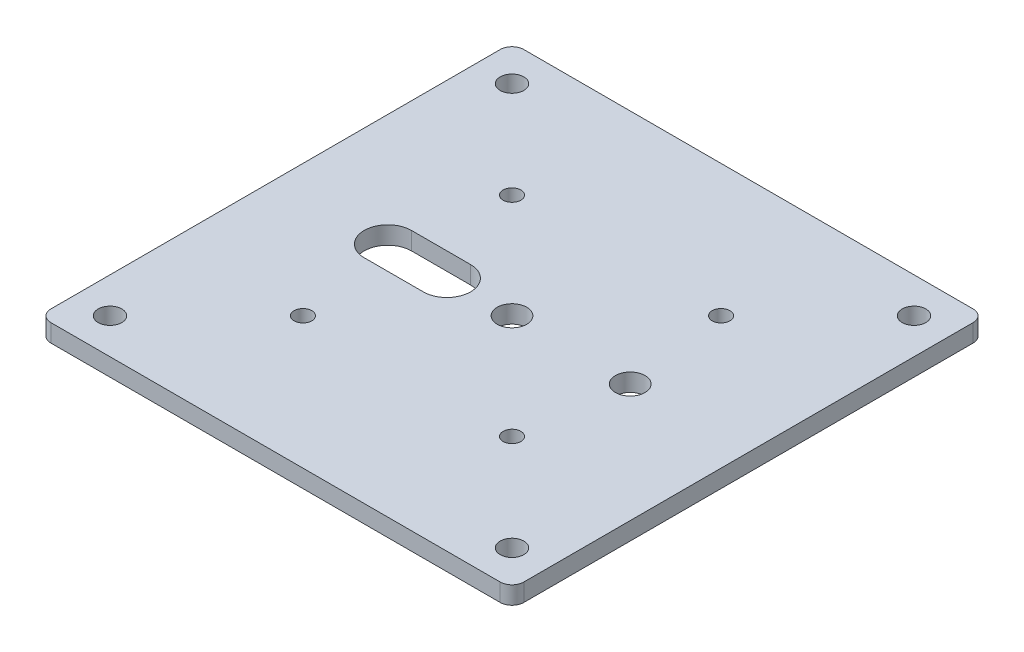
ISO-10303-21;
HEADER;
FILE_DESCRIPTION(('STEP AP214'),'2;1');
FILE_NAME('part.step','',(''),(''),'','','');
FILE_SCHEMA(('AUTOMOTIVE_DESIGN { 1 0 10303 214 1 1 1 1 }'));
ENDSEC;
DATA;
#1=APPLICATION_CONTEXT('core data for automotive mechanical design processes');
#2=APPLICATION_PROTOCOL_DEFINITION('international standard','automotive_design',2000,#1);
#3=PRODUCT_CONTEXT('',#1,'mechanical');
#4=PRODUCT('Part','Part','',(#3));
#5=PRODUCT_RELATED_PRODUCT_CATEGORY('part','',(#4));
#6=PRODUCT_DEFINITION_FORMATION('','',#4);
#7=PRODUCT_DEFINITION_CONTEXT('part definition',#1,'design');
#8=PRODUCT_DEFINITION('design','',#6,#7);
#9=PRODUCT_DEFINITION_SHAPE('','',#8);
#10=(LENGTH_UNIT() NAMED_UNIT(*) SI_UNIT(.MILLI.,.METRE.));
#11=(NAMED_UNIT(*) PLANE_ANGLE_UNIT() SI_UNIT($,.RADIAN.));
#12=(NAMED_UNIT(*) SI_UNIT($,.STERADIAN.) SOLID_ANGLE_UNIT());
#13=UNCERTAINTY_MEASURE_WITH_UNIT(LENGTH_MEASURE(1.E-05),#10,'distance_accuracy_value','');
#14=(GEOMETRIC_REPRESENTATION_CONTEXT(3) GLOBAL_UNCERTAINTY_ASSIGNED_CONTEXT((#13)) GLOBAL_UNIT_ASSIGNED_CONTEXT((#10,
#11,#12)) REPRESENTATION_CONTEXT('',''));
#15=CARTESIAN_POINT('',(0.,0.,0.));
#16=DIRECTION('',(0.,0.,1.));
#17=DIRECTION('',(1.,0.,0.));
#18=AXIS2_PLACEMENT_3D('',#15,#16,#17);
#19=CARTESIAN_POINT('',(0.,3.,-80.));
#20=DIRECTION('',(0.,-1.,0.));
#21=DIRECTION('',(0.,0.,-1.));
#22=AXIS2_PLACEMENT_3D('',#19,#20,#21);
#23=PLANE('',#22);
#24=CARTESIAN_POINT('',(74.,3.,-6.00000000000001));
#25=DIRECTION('',(0.,1.,0.));
#26=DIRECTION('',(0.,0.,1.));
#27=AXIS2_PLACEMENT_3D('',#24,#25,#26);
#28=CIRCLE('',#27,2.00000000000001);
#29=CARTESIAN_POINT('',(74.,3.,-3.99999999999999));
#30=VERTEX_POINT('',#29);
#31=EDGE_CURVE('E401',#30,#30,#28,.T.);
#32=ORIENTED_EDGE('',*,*,#31,.F.);
#33=EDGE_LOOP('',(#32));
#34=FACE_BOUND('',#33,.T.);
#35=CARTESIAN_POINT('',(6.00000000000001,3.,-74.));
#36=DIRECTION('',(0.,1.,0.));
#37=DIRECTION('',(0.,0.,1.));
#38=AXIS2_PLACEMENT_3D('',#35,#36,#37);
#39=CIRCLE('',#38,2.);
#40=CARTESIAN_POINT('',(6.00000000000001,3.,-72.));
#41=VERTEX_POINT('',#40);
#42=EDGE_CURVE('E156',#41,#41,#39,.T.);
#43=ORIENTED_EDGE('',*,*,#42,.F.);
#44=EDGE_LOOP('',(#43));
#45=FACE_BOUND('',#44,.T.);
#46=CARTESIAN_POINT('',(57.6776695296637,3.,-22.3223304703363));
#47=DIRECTION('',(0.,1.,0.));
#48=DIRECTION('',(0.,0.,-1.));
#49=AXIS2_PLACEMENT_3D('',#46,#47,#48);
#50=CIRCLE('',#49,1.5);
#51=CARTESIAN_POINT('',(57.6776695296637,3.,-23.8223304703363));
#52=VERTEX_POINT('',#51);
#53=EDGE_CURVE('E167',#52,#52,#50,.T.);
#54=ORIENTED_EDGE('',*,*,#53,.F.);
#55=EDGE_LOOP('',(#54));
#56=FACE_BOUND('',#55,.T.);
#57=CARTESIAN_POINT('',(22.3223304703363,3.,-22.3223304703363));
#58=DIRECTION('',(0.,1.,0.));
#59=DIRECTION('',(0.,0.,-1.));
#60=AXIS2_PLACEMENT_3D('',#57,#58,#59);
#61=CIRCLE('',#60,1.5);
#62=CARTESIAN_POINT('',(22.3223304703363,3.,-23.8223304703363));
#63=VERTEX_POINT('',#62);
#64=EDGE_CURVE('E179',#63,#63,#61,.T.);
#65=ORIENTED_EDGE('',*,*,#64,.F.);
#66=EDGE_LOOP('',(#65));
#67=FACE_BOUND('',#66,.T.);
#68=CARTESIAN_POINT('',(60.,3.,-40.));
#69=DIRECTION('',(0.,1.,0.));
#70=DIRECTION('',(0.,0.,1.));
#71=AXIS2_PLACEMENT_3D('',#68,#69,#70);
#72=CIRCLE('',#71,2.5);
#73=CARTESIAN_POINT('',(60.,3.,-37.5));
#74=VERTEX_POINT('',#73);
#75=EDGE_CURVE('E191',#74,#74,#72,.T.);
#76=ORIENTED_EDGE('',*,*,#75,.F.);
#77=EDGE_LOOP('',(#76));
#78=FACE_BOUND('',#77,.T.);
#79=DIRECTION('',(0.,0.,-1.));
#80=VECTOR('',#79,1.);
#81=CARTESIAN_POINT('',(80.,3.,0.));
#82=LINE('',#81,#80);
#83=CARTESIAN_POINT('',(80.,3.,-2.));
#84=VERTEX_POINT('',#83);
#85=CARTESIAN_POINT('',(80.,3.,-78.));
#86=VERTEX_POINT('',#85);
#87=EDGE_CURVE('E208',#84,#86,#82,.T.);
#88=ORIENTED_EDGE('',*,*,#87,.T.);
#89=CARTESIAN_POINT('',(78.,3.,-78.));
#90=DIRECTION('',(0.,-1.,0.));
#91=DIRECTION('',(0.,0.,-1.));
#92=AXIS2_PLACEMENT_3D('',#89,#90,#91);
#93=CIRCLE('',#92,2.);
#94=CARTESIAN_POINT('',(78.,3.,-80.));
#95=VERTEX_POINT('',#94);
#96=EDGE_CURVE('E246',#86,#95,#93,.F.);
#97=ORIENTED_EDGE('',*,*,#96,.T.);
#98=DIRECTION('',(-1.,0.,0.));
#99=VECTOR('',#98,1.);
#100=CARTESIAN_POINT('',(0.,3.,-80.));
#101=LINE('',#100,#99);
#102=CARTESIAN_POINT('',(2.,3.,-80.));
#103=VERTEX_POINT('',#102);
#104=EDGE_CURVE('E211',#95,#103,#101,.T.);
#105=ORIENTED_EDGE('',*,*,#104,.T.);
#106=CARTESIAN_POINT('',(2.,3.,-78.));
#107=DIRECTION('',(0.,-1.,0.));
#108=DIRECTION('',(0.,0.,-1.));
#109=AXIS2_PLACEMENT_3D('',#106,#107,#108);
#110=CIRCLE('',#109,2.);
#111=CARTESIAN_POINT('',(0.,3.,-78.));
#112=VERTEX_POINT('',#111);
#113=EDGE_CURVE('E242',#103,#112,#110,.F.);
#114=ORIENTED_EDGE('',*,*,#113,.T.);
#115=DIRECTION('',(0.,0.,1.));
#116=VECTOR('',#115,1.);
#117=CARTESIAN_POINT('',(0.,3.,0.));
#118=LINE('',#117,#116);
#119=CARTESIAN_POINT('',(0.,3.,-2.));
#120=VERTEX_POINT('',#119);
#121=EDGE_CURVE('E203',#112,#120,#118,.T.);
#122=ORIENTED_EDGE('',*,*,#121,.T.);
#123=CARTESIAN_POINT('',(2.,3.,-2.));
#124=DIRECTION('',(0.,-1.,0.));
#125=DIRECTION('',(0.,0.,-1.));
#126=AXIS2_PLACEMENT_3D('',#123,#124,#125);
#127=CIRCLE('',#126,2.);
#128=CARTESIAN_POINT('',(2.,3.,0.));
#129=VERTEX_POINT('',#128);
#130=EDGE_CURVE('E52',#120,#129,#127,.F.);
#131=ORIENTED_EDGE('',*,*,#130,.T.);
#132=DIRECTION('',(1.,0.,0.));
#133=VECTOR('',#132,1.);
#134=CARTESIAN_POINT('',(0.,3.,0.));
#135=LINE('',#134,#133);
#136=CARTESIAN_POINT('',(78.,3.,0.));
#137=VERTEX_POINT('',#136);
#138=EDGE_CURVE('E205',#129,#137,#135,.T.);
#139=ORIENTED_EDGE('',*,*,#138,.T.);
#140=CARTESIAN_POINT('',(78.,3.,-2.));
#141=DIRECTION('',(0.,-1.,0.));
#142=DIRECTION('',(0.,0.,-1.));
#143=AXIS2_PLACEMENT_3D('',#140,#141,#142);
#144=CIRCLE('',#143,2.);
#145=EDGE_CURVE('E244',#137,#84,#144,.F.);
#146=ORIENTED_EDGE('',*,*,#145,.T.);
#147=EDGE_LOOP('',(#88,#97,#105,#114,#122,#131,#139,#146));
#148=FACE_BOUND('',#147,.T.);
#149=CARTESIAN_POINT('',(40.,3.,-40.));
#150=DIRECTION('',(0.,1.,0.));
#151=DIRECTION('',(0.,0.,1.));
#152=AXIS2_PLACEMENT_3D('',#149,#150,#151);
#153=CIRCLE('',#152,2.5);
#154=CARTESIAN_POINT('',(40.,3.,-37.5));
#155=VERTEX_POINT('',#154);
#156=EDGE_CURVE('E197',#155,#155,#153,.T.);
#157=ORIENTED_EDGE('',*,*,#156,.F.);
#158=EDGE_LOOP('',(#157));
#159=FACE_BOUND('',#158,.T.);
#160=CARTESIAN_POINT('',(57.6776695296637,3.,-57.6776695296637));
#161=DIRECTION('',(0.,1.,0.));
#162=DIRECTION('',(0.,0.,1.));
#163=AXIS2_PLACEMENT_3D('',#160,#161,#162);
#164=CIRCLE('',#163,1.5);
#165=CARTESIAN_POINT('',(57.6776695296637,3.,-56.1776695296637));
#166=VERTEX_POINT('',#165);
#167=EDGE_CURVE('E185',#166,#166,#164,.T.);
#168=ORIENTED_EDGE('',*,*,#167,.F.);
#169=EDGE_LOOP('',(#168));
#170=FACE_BOUND('',#169,.T.);
#171=CARTESIAN_POINT('',(22.3223304703363,3.,-57.6776695296637));
#172=DIRECTION('',(0.,1.,0.));
#173=DIRECTION('',(0.,0.,1.));
#174=AXIS2_PLACEMENT_3D('',#171,#172,#173);
#175=CIRCLE('',#174,1.5);
#176=CARTESIAN_POINT('',(22.3223304703363,3.,-56.1776695296637));
#177=VERTEX_POINT('',#176);
#178=EDGE_CURVE('E173',#177,#177,#175,.T.);
#179=ORIENTED_EDGE('',*,*,#178,.F.);
#180=EDGE_LOOP('',(#179));
#181=FACE_BOUND('',#180,.T.);
#182=CARTESIAN_POINT('',(19.,3.,-40.));
#183=DIRECTION('',(0.,1.,0.));
#184=DIRECTION('',(0.,0.,1.));
#185=AXIS2_PLACEMENT_3D('',#182,#183,#184);
#186=CIRCLE('',#185,4.);
#187=CARTESIAN_POINT('',(19.,3.,-44.));
#188=VERTEX_POINT('',#187);
#189=CARTESIAN_POINT('',(19.,3.,-36.));
#190=VERTEX_POINT('',#189);
#191=EDGE_CURVE('E121',#188,#190,#186,.T.);
#192=ORIENTED_EDGE('',*,*,#191,.F.);
#193=DIRECTION('',(-1.,0.,0.));
#194=VECTOR('',#193,1.);
#195=CARTESIAN_POINT('',(19.,3.,-44.));
#196=LINE('',#195,#194);
#197=CARTESIAN_POINT('',(29.,3.,-44.));
#198=VERTEX_POINT('',#197);
#199=EDGE_CURVE('E149',#198,#188,#196,.T.);
#200=ORIENTED_EDGE('',*,*,#199,.F.);
#201=CARTESIAN_POINT('',(29.,3.,-40.));
#202=DIRECTION('',(0.,1.,0.));
#203=DIRECTION('',(0.,0.,1.));
#204=AXIS2_PLACEMENT_3D('',#201,#202,#203);
#205=CIRCLE('',#204,4.);
#206=CARTESIAN_POINT('',(29.,3.,-36.));
#207=VERTEX_POINT('',#206);
#208=EDGE_CURVE('E147',#207,#198,#205,.T.);
#209=ORIENTED_EDGE('',*,*,#208,.F.);
#210=DIRECTION('',(1.,0.,0.));
#211=VECTOR('',#210,1.);
#212=CARTESIAN_POINT('',(19.,3.,-36.));
#213=LINE('',#212,#211);
#214=EDGE_CURVE('E131',#190,#207,#213,.T.);
#215=ORIENTED_EDGE('',*,*,#214,.F.);
#216=EDGE_LOOP('',(#192,#200,#209,#215));
#217=FACE_BOUND('',#216,.T.);
#218=CARTESIAN_POINT('',(74.,3.,-74.));
#219=DIRECTION('',(0.,1.,0.));
#220=DIRECTION('',(0.,0.,-1.));
#221=AXIS2_PLACEMENT_3D('',#218,#219,#220);
#222=CIRCLE('',#221,2.00000000000001);
#223=CARTESIAN_POINT('',(74.,3.,-76.));
#224=VERTEX_POINT('',#223);
#225=EDGE_CURVE('E406',#224,#224,#222,.T.);
#226=ORIENTED_EDGE('',*,*,#225,.F.);
#227=EDGE_LOOP('',(#226));
#228=FACE_BOUND('',#227,.T.);
#229=CARTESIAN_POINT('',(6.00000000000001,3.,-6.00000000000001));
#230=DIRECTION('',(0.,1.,0.));
#231=DIRECTION('',(0.,0.,-1.));
#232=AXIS2_PLACEMENT_3D('',#229,#230,#231);
#233=CIRCLE('',#232,2.);
#234=CARTESIAN_POINT('',(6.00000000000001,3.,-8.00000000000001));
#235=VERTEX_POINT('',#234);
#236=EDGE_CURVE('E396',#235,#235,#233,.T.);
#237=ORIENTED_EDGE('',*,*,#236,.F.);
#238=EDGE_LOOP('',(#237));
#239=FACE_BOUND('',#238,.T.);
#240=ADVANCED_FACE('F30',(#34,#45,#56,#67,#78,#148,#159,#170,#181,#217,#228,#239),#23,.F.);
#241=CARTESIAN_POINT('',(0.,0.,-80.));
#242=DIRECTION('',(0.,-1.,0.));
#243=DIRECTION('',(0.,0.,-1.));
#244=AXIS2_PLACEMENT_3D('',#241,#242,#243);
#245=PLANE('',#244);
#246=CARTESIAN_POINT('',(74.,0.,-6.00000000000001));
#247=DIRECTION('',(0.,1.,0.));
#248=DIRECTION('',(0.,0.,1.));
#249=AXIS2_PLACEMENT_3D('',#246,#247,#248);
#250=CIRCLE('',#249,2.00000000000001);
#251=CARTESIAN_POINT('',(74.,0.,-3.99999999999999));
#252=VERTEX_POINT('',#251);
#253=EDGE_CURVE('E398',#252,#252,#250,.T.);
#254=ORIENTED_EDGE('',*,*,#253,.T.);
#255=EDGE_LOOP('',(#254));
#256=FACE_BOUND('',#255,.T.);
#257=CARTESIAN_POINT('',(6.00000000000001,0.,-74.));
#258=DIRECTION('',(0.,1.,0.));
#259=DIRECTION('',(0.,0.,1.));
#260=AXIS2_PLACEMENT_3D('',#257,#258,#259);
#261=CIRCLE('',#260,2.);
#262=CARTESIAN_POINT('',(6.00000000000001,0.,-72.));
#263=VERTEX_POINT('',#262);
#264=EDGE_CURVE('E409',#263,#263,#261,.T.);
#265=ORIENTED_EDGE('',*,*,#264,.T.);
#266=EDGE_LOOP('',(#265));
#267=FACE_BOUND('',#266,.T.);
#268=CARTESIAN_POINT('',(57.6776695296637,0.,-22.3223304703363));
#269=DIRECTION('',(0.,1.,0.));
#270=DIRECTION('',(0.,0.,-1.));
#271=AXIS2_PLACEMENT_3D('',#268,#269,#270);
#272=CIRCLE('',#271,1.5);
#273=CARTESIAN_POINT('',(57.6776695296637,0.,-23.8223304703363));
#274=VERTEX_POINT('',#273);
#275=EDGE_CURVE('E141',#274,#274,#272,.T.);
#276=ORIENTED_EDGE('',*,*,#275,.T.);
#277=EDGE_LOOP('',(#276));
#278=FACE_BOUND('',#277,.T.);
#279=CARTESIAN_POINT('',(22.3223304703363,0.,-22.3223304703363));
#280=DIRECTION('',(0.,1.,0.));
#281=DIRECTION('',(0.,0.,-1.));
#282=AXIS2_PLACEMENT_3D('',#279,#280,#281);
#283=CIRCLE('',#282,1.5);
#284=CARTESIAN_POINT('',(22.3223304703363,0.,-23.8223304703363));
#285=VERTEX_POINT('',#284);
#286=EDGE_CURVE('E176',#285,#285,#283,.T.);
#287=ORIENTED_EDGE('',*,*,#286,.T.);
#288=EDGE_LOOP('',(#287));
#289=FACE_BOUND('',#288,.T.);
#290=CARTESIAN_POINT('',(60.,0.,-40.));
#291=DIRECTION('',(0.,1.,0.));
#292=DIRECTION('',(0.,0.,1.));
#293=AXIS2_PLACEMENT_3D('',#290,#291,#292);
#294=CIRCLE('',#293,2.5);
#295=CARTESIAN_POINT('',(60.,0.,-37.5));
#296=VERTEX_POINT('',#295);
#297=EDGE_CURVE('E188',#296,#296,#294,.T.);
#298=ORIENTED_EDGE('',*,*,#297,.T.);
#299=EDGE_LOOP('',(#298));
#300=FACE_BOUND('',#299,.T.);
#301=DIRECTION('',(-1.,0.,0.));
#302=VECTOR('',#301,1.);
#303=CARTESIAN_POINT('',(0.,0.,-80.));
#304=LINE('',#303,#302);
#305=CARTESIAN_POINT('',(78.,0.,-80.));
#306=VERTEX_POINT('',#305);
#307=CARTESIAN_POINT('',(2.,0.,-80.));
#308=VERTEX_POINT('',#307);
#309=EDGE_CURVE('E206',#306,#308,#304,.T.);
#310=ORIENTED_EDGE('',*,*,#309,.F.);
#311=CARTESIAN_POINT('',(78.,0.,-78.));
#312=DIRECTION('',(0.,-1.,0.));
#313=DIRECTION('',(0.,0.,-1.));
#314=AXIS2_PLACEMENT_3D('',#311,#312,#313);
#315=CIRCLE('',#314,2.);
#316=CARTESIAN_POINT('',(80.,0.,-78.));
#317=VERTEX_POINT('',#316);
#318=EDGE_CURVE('E234',#306,#317,#315,.T.);
#319=ORIENTED_EDGE('',*,*,#318,.T.);
#320=DIRECTION('',(0.,0.,-1.));
#321=VECTOR('',#320,1.);
#322=CARTESIAN_POINT('',(80.,0.,0.));
#323=LINE('',#322,#321);
#324=CARTESIAN_POINT('',(80.,0.,-2.));
#325=VERTEX_POINT('',#324);
#326=EDGE_CURVE('E219',#325,#317,#323,.T.);
#327=ORIENTED_EDGE('',*,*,#326,.F.);
#328=CARTESIAN_POINT('',(78.,0.,-2.));
#329=DIRECTION('',(0.,-1.,0.));
#330=DIRECTION('',(0.,0.,-1.));
#331=AXIS2_PLACEMENT_3D('',#328,#329,#330);
#332=CIRCLE('',#331,2.);
#333=CARTESIAN_POINT('',(78.,0.,0.));
#334=VERTEX_POINT('',#333);
#335=EDGE_CURVE('E232',#325,#334,#332,.T.);
#336=ORIENTED_EDGE('',*,*,#335,.T.);
#337=DIRECTION('',(1.,0.,0.));
#338=VECTOR('',#337,1.);
#339=CARTESIAN_POINT('',(0.,0.,0.));
#340=LINE('',#339,#338);
#341=CARTESIAN_POINT('',(2.,0.,0.));
#342=VERTEX_POINT('',#341);
#343=EDGE_CURVE('E217',#342,#334,#340,.T.);
#344=ORIENTED_EDGE('',*,*,#343,.F.);
#345=CARTESIAN_POINT('',(2.,0.,-2.));
#346=DIRECTION('',(0.,-1.,0.));
#347=DIRECTION('',(0.,0.,-1.));
#348=AXIS2_PLACEMENT_3D('',#345,#346,#347);
#349=CIRCLE('',#348,2.);
#350=CARTESIAN_POINT('',(0.,0.,-2.));
#351=VERTEX_POINT('',#350);
#352=EDGE_CURVE('E228',#342,#351,#349,.T.);
#353=ORIENTED_EDGE('',*,*,#352,.T.);
#354=DIRECTION('',(0.,0.,1.));
#355=VECTOR('',#354,1.);
#356=CARTESIAN_POINT('',(0.,0.,0.));
#357=LINE('',#356,#355);
#358=CARTESIAN_POINT('',(0.,0.,-78.));
#359=VERTEX_POINT('',#358);
#360=EDGE_CURVE('E200',#359,#351,#357,.T.);
#361=ORIENTED_EDGE('',*,*,#360,.F.);
#362=CARTESIAN_POINT('',(2.,0.,-78.));
#363=DIRECTION('',(0.,-1.,0.));
#364=DIRECTION('',(0.,0.,-1.));
#365=AXIS2_PLACEMENT_3D('',#362,#363,#364);
#366=CIRCLE('',#365,2.);
#367=EDGE_CURVE('E230',#359,#308,#366,.T.);
#368=ORIENTED_EDGE('',*,*,#367,.T.);
#369=EDGE_LOOP('',(#310,#319,#327,#336,#344,#353,#361,#368));
#370=FACE_BOUND('',#369,.T.);
#371=CARTESIAN_POINT('',(40.,0.,-40.));
#372=DIRECTION('',(0.,1.,0.));
#373=DIRECTION('',(0.,0.,1.));
#374=AXIS2_PLACEMENT_3D('',#371,#372,#373);
#375=CIRCLE('',#374,2.5);
#376=CARTESIAN_POINT('',(40.,0.,-37.5));
#377=VERTEX_POINT('',#376);
#378=EDGE_CURVE('E194',#377,#377,#375,.T.);
#379=ORIENTED_EDGE('',*,*,#378,.T.);
#380=EDGE_LOOP('',(#379));
#381=FACE_BOUND('',#380,.T.);
#382=CARTESIAN_POINT('',(57.6776695296637,0.,-57.6776695296637));
#383=DIRECTION('',(0.,1.,0.));
#384=DIRECTION('',(0.,0.,1.));
#385=AXIS2_PLACEMENT_3D('',#382,#383,#384);
#386=CIRCLE('',#385,1.5);
#387=CARTESIAN_POINT('',(57.6776695296637,0.,-56.1776695296637));
#388=VERTEX_POINT('',#387);
#389=EDGE_CURVE('E182',#388,#388,#386,.T.);
#390=ORIENTED_EDGE('',*,*,#389,.T.);
#391=EDGE_LOOP('',(#390));
#392=FACE_BOUND('',#391,.T.);
#393=CARTESIAN_POINT('',(22.3223304703363,0.,-57.6776695296637));
#394=DIRECTION('',(0.,1.,0.));
#395=DIRECTION('',(0.,0.,1.));
#396=AXIS2_PLACEMENT_3D('',#393,#394,#395);
#397=CIRCLE('',#396,1.5);
#398=CARTESIAN_POINT('',(22.3223304703363,0.,-56.1776695296637));
#399=VERTEX_POINT('',#398);
#400=EDGE_CURVE('E170',#399,#399,#397,.T.);
#401=ORIENTED_EDGE('',*,*,#400,.T.);
#402=EDGE_LOOP('',(#401));
#403=FACE_BOUND('',#402,.T.);
#404=DIRECTION('',(-1.,0.,0.));
#405=VECTOR('',#404,1.);
#406=CARTESIAN_POINT('',(19.,0.,-44.));
#407=LINE('',#406,#405);
#408=CARTESIAN_POINT('',(29.,0.,-44.));
#409=VERTEX_POINT('',#408);
#410=CARTESIAN_POINT('',(19.,0.,-44.));
#411=VERTEX_POINT('',#410);
#412=EDGE_CURVE('E132',#409,#411,#407,.T.);
#413=ORIENTED_EDGE('',*,*,#412,.T.);
#414=CARTESIAN_POINT('',(19.,0.,-40.));
#415=DIRECTION('',(0.,1.,0.));
#416=DIRECTION('',(0.,0.,-1.));
#417=AXIS2_PLACEMENT_3D('',#414,#415,#416);
#418=CIRCLE('',#417,4.);
#419=CARTESIAN_POINT('',(19.,0.,-36.));
#420=VERTEX_POINT('',#419);
#421=EDGE_CURVE('E154',#411,#420,#418,.T.);
#422=ORIENTED_EDGE('',*,*,#421,.T.);
#423=DIRECTION('',(1.,0.,0.));
#424=VECTOR('',#423,1.);
#425=CARTESIAN_POINT('',(19.,0.,-36.));
#426=LINE('',#425,#424);
#427=CARTESIAN_POINT('',(29.,0.,-36.));
#428=VERTEX_POINT('',#427);
#429=EDGE_CURVE('E139',#420,#428,#426,.T.);
#430=ORIENTED_EDGE('',*,*,#429,.T.);
#431=CARTESIAN_POINT('',(29.,0.,-40.));
#432=DIRECTION('',(0.,1.,0.));
#433=DIRECTION('',(0.,0.,-1.));
#434=AXIS2_PLACEMENT_3D('',#431,#432,#433);
#435=CIRCLE('',#434,4.);
#436=EDGE_CURVE('E158',#428,#409,#435,.T.);
#437=ORIENTED_EDGE('',*,*,#436,.T.);
#438=EDGE_LOOP('',(#413,#422,#430,#437));
#439=FACE_BOUND('',#438,.T.);
#440=CARTESIAN_POINT('',(74.,0.,-74.));
#441=DIRECTION('',(0.,1.,0.));
#442=DIRECTION('',(0.,0.,-1.));
#443=AXIS2_PLACEMENT_3D('',#440,#441,#442);
#444=CIRCLE('',#443,2.00000000000001);
#445=CARTESIAN_POINT('',(74.,0.,-76.));
#446=VERTEX_POINT('',#445);
#447=EDGE_CURVE('E392',#446,#446,#444,.T.);
#448=ORIENTED_EDGE('',*,*,#447,.T.);
#449=EDGE_LOOP('',(#448));
#450=FACE_BOUND('',#449,.T.);
#451=CARTESIAN_POINT('',(6.00000000000001,0.,-6.00000000000001));
#452=DIRECTION('',(0.,1.,0.));
#453=DIRECTION('',(0.,0.,-1.));
#454=AXIS2_PLACEMENT_3D('',#451,#452,#453);
#455=CIRCLE('',#454,2.);
#456=CARTESIAN_POINT('',(6.00000000000001,0.,-8.00000000000001));
#457=VERTEX_POINT('',#456);
#458=EDGE_CURVE('E395',#457,#457,#455,.T.);
#459=ORIENTED_EDGE('',*,*,#458,.T.);
#460=EDGE_LOOP('',(#459));
#461=FACE_BOUND('',#460,.T.);
#462=ADVANCED_FACE('F265',(#256,#267,#278,#289,#300,#370,#381,#392,#403,#439,#450,#461),#245,.T.);
#463=CARTESIAN_POINT('',(0.,3.,0.));
#464=DIRECTION('',(1.,0.,0.));
#465=DIRECTION('',(0.,0.,-1.));
#466=AXIS2_PLACEMENT_3D('',#463,#464,#465);
#467=PLANE('',#466);
#468=ORIENTED_EDGE('',*,*,#121,.F.);
#469=DIRECTION('',(0.,-1.,0.));
#470=VECTOR('',#469,1.);
#471=CARTESIAN_POINT('',(0.,3.,-78.));
#472=LINE('',#471,#470);
#473=EDGE_CURVE('E11',#112,#359,#472,.T.);
#474=ORIENTED_EDGE('',*,*,#473,.T.);
#475=ORIENTED_EDGE('',*,*,#360,.T.);
#476=DIRECTION('',(0.,-1.,0.));
#477=VECTOR('',#476,1.);
#478=CARTESIAN_POINT('',(0.,3.,-2.));
#479=LINE('',#478,#477);
#480=EDGE_CURVE('E38',#351,#120,#479,.F.);
#481=ORIENTED_EDGE('',*,*,#480,.T.);
#482=EDGE_LOOP('',(#468,#474,#475,#481));
#483=FACE_BOUND('',#482,.T.);
#484=ADVANCED_FACE('F254',(#483),#467,.F.);
#485=CARTESIAN_POINT('',(0.,3.,0.));
#486=DIRECTION('',(0.,0.,-1.));
#487=DIRECTION('',(-1.,0.,0.));
#488=AXIS2_PLACEMENT_3D('',#485,#486,#487);
#489=PLANE('',#488);
#490=ORIENTED_EDGE('',*,*,#343,.T.);
#491=DIRECTION('',(0.,-1.,0.));
#492=VECTOR('',#491,1.);
#493=CARTESIAN_POINT('',(78.,3.,0.));
#494=LINE('',#493,#492);
#495=EDGE_CURVE('E45',#334,#137,#494,.F.);
#496=ORIENTED_EDGE('',*,*,#495,.T.);
#497=ORIENTED_EDGE('',*,*,#138,.F.);
#498=DIRECTION('',(0.,-1.,0.));
#499=VECTOR('',#498,1.);
#500=CARTESIAN_POINT('',(2.,3.,0.));
#501=LINE('',#500,#499);
#502=EDGE_CURVE('E248',#129,#342,#501,.T.);
#503=ORIENTED_EDGE('',*,*,#502,.T.);
#504=EDGE_LOOP('',(#490,#496,#497,#503));
#505=FACE_BOUND('',#504,.T.);
#506=ADVANCED_FACE('F262',(#505),#489,.F.);
#507=CARTESIAN_POINT('',(80.,3.,0.));
#508=DIRECTION('',(-1.,0.,0.));
#509=DIRECTION('',(0.,0.,1.));
#510=AXIS2_PLACEMENT_3D('',#507,#508,#509);
#511=PLANE('',#510);
#512=ORIENTED_EDGE('',*,*,#326,.T.);
#513=DIRECTION('',(0.,-1.,0.));
#514=VECTOR('',#513,1.);
#515=CARTESIAN_POINT('',(80.,3.,-78.));
#516=LINE('',#515,#514);
#517=EDGE_CURVE('E239',#317,#86,#516,.F.);
#518=ORIENTED_EDGE('',*,*,#517,.T.);
#519=ORIENTED_EDGE('',*,*,#87,.F.);
#520=DIRECTION('',(0.,-1.,0.));
#521=VECTOR('',#520,1.);
#522=CARTESIAN_POINT('',(80.,3.,-2.));
#523=LINE('',#522,#521);
#524=EDGE_CURVE('E236',#84,#325,#523,.T.);
#525=ORIENTED_EDGE('',*,*,#524,.T.);
#526=EDGE_LOOP('',(#512,#518,#519,#525));
#527=FACE_BOUND('',#526,.T.);
#528=ADVANCED_FACE('F274',(#527),#511,.F.);
#529=CARTESIAN_POINT('',(0.,3.,-80.));
#530=DIRECTION('',(0.,0.,1.));
#531=DIRECTION('',(1.,0.,0.));
#532=AXIS2_PLACEMENT_3D('',#529,#530,#531);
#533=PLANE('',#532);
#534=ORIENTED_EDGE('',*,*,#104,.F.);
#535=DIRECTION('',(0.,-1.,0.));
#536=VECTOR('',#535,1.);
#537=CARTESIAN_POINT('',(78.,3.,-80.));
#538=LINE('',#537,#536);
#539=EDGE_CURVE('E225',#95,#306,#538,.T.);
#540=ORIENTED_EDGE('',*,*,#539,.T.);
#541=ORIENTED_EDGE('',*,*,#309,.T.);
#542=DIRECTION('',(0.,-1.,0.));
#543=VECTOR('',#542,1.);
#544=CARTESIAN_POINT('',(2.,3.,-80.));
#545=LINE('',#544,#543);
#546=EDGE_CURVE('E214',#308,#103,#545,.F.);
#547=ORIENTED_EDGE('',*,*,#546,.T.);
#548=EDGE_LOOP('',(#534,#540,#541,#547));
#549=FACE_BOUND('',#548,.T.);
#550=ADVANCED_FACE('F282',(#549),#533,.F.);
#551=CARTESIAN_POINT('',(40.,3.,-40.));
#552=DIRECTION('',(0.,-1.,0.));
#553=DIRECTION('',(0.,0.,-1.));
#554=AXIS2_PLACEMENT_3D('',#551,#552,#553);
#555=CYLINDRICAL_SURFACE('',#554,2.5);
#556=ORIENTED_EDGE('',*,*,#156,.T.);
#557=EDGE_LOOP('',(#556));
#558=FACE_BOUND('',#557,.T.);
#559=ORIENTED_EDGE('',*,*,#378,.F.);
#560=EDGE_LOOP('',(#559));
#561=FACE_BOUND('',#560,.T.);
#562=ADVANCED_FACE('F303',(#558,#561),#555,.F.);
#563=CARTESIAN_POINT('',(60.,3.,-40.));
#564=DIRECTION('',(0.,-1.,0.));
#565=DIRECTION('',(0.,0.,-1.));
#566=AXIS2_PLACEMENT_3D('',#563,#564,#565);
#567=CYLINDRICAL_SURFACE('',#566,2.5);
#568=ORIENTED_EDGE('',*,*,#75,.T.);
#569=EDGE_LOOP('',(#568));
#570=FACE_BOUND('',#569,.T.);
#571=ORIENTED_EDGE('',*,*,#297,.F.);
#572=EDGE_LOOP('',(#571));
#573=FACE_BOUND('',#572,.T.);
#574=ADVANCED_FACE('F364',(#570,#573),#567,.F.);
#575=CARTESIAN_POINT('',(57.6776695296637,3.,-57.6776695296637));
#576=DIRECTION('',(0.,-1.,0.));
#577=DIRECTION('',(0.,0.,-1.));
#578=AXIS2_PLACEMENT_3D('',#575,#576,#577);
#579=CYLINDRICAL_SURFACE('',#578,1.5);
#580=ORIENTED_EDGE('',*,*,#167,.T.);
#581=EDGE_LOOP('',(#580));
#582=FACE_BOUND('',#581,.T.);
#583=ORIENTED_EDGE('',*,*,#389,.F.);
#584=EDGE_LOOP('',(#583));
#585=FACE_BOUND('',#584,.T.);
#586=ADVANCED_FACE('F361',(#582,#585),#579,.F.);
#587=CARTESIAN_POINT('',(22.3223304703363,3.,-22.3223304703363));
#588=DIRECTION('',(0.,-1.,0.));
#589=DIRECTION('',(0.,0.,-1.));
#590=AXIS2_PLACEMENT_3D('',#587,#588,#589);
#591=CYLINDRICAL_SURFACE('',#590,1.5);
#592=ORIENTED_EDGE('',*,*,#64,.T.);
#593=EDGE_LOOP('',(#592));
#594=FACE_BOUND('',#593,.T.);
#595=ORIENTED_EDGE('',*,*,#286,.F.);
#596=EDGE_LOOP('',(#595));
#597=FACE_BOUND('',#596,.T.);
#598=ADVANCED_FACE('F357',(#594,#597),#591,.F.);
#599=CARTESIAN_POINT('',(22.3223304703363,3.,-57.6776695296637));
#600=DIRECTION('',(0.,-1.,0.));
#601=DIRECTION('',(0.,0.,-1.));
#602=AXIS2_PLACEMENT_3D('',#599,#600,#601);
#603=CYLINDRICAL_SURFACE('',#602,1.5);
#604=ORIENTED_EDGE('',*,*,#178,.T.);
#605=EDGE_LOOP('',(#604));
#606=FACE_BOUND('',#605,.T.);
#607=ORIENTED_EDGE('',*,*,#400,.F.);
#608=EDGE_LOOP('',(#607));
#609=FACE_BOUND('',#608,.T.);
#610=ADVANCED_FACE('F353',(#606,#609),#603,.F.);
#611=CARTESIAN_POINT('',(57.6776695296637,3.,-22.3223304703363));
#612=DIRECTION('',(0.,-1.,0.));
#613=DIRECTION('',(0.,0.,-1.));
#614=AXIS2_PLACEMENT_3D('',#611,#612,#613);
#615=CYLINDRICAL_SURFACE('',#614,1.5);
#616=ORIENTED_EDGE('',*,*,#53,.T.);
#617=EDGE_LOOP('',(#616));
#618=FACE_BOUND('',#617,.T.);
#619=ORIENTED_EDGE('',*,*,#275,.F.);
#620=EDGE_LOOP('',(#619));
#621=FACE_BOUND('',#620,.T.);
#622=ADVANCED_FACE('F350',(#618,#621),#615,.F.);
#623=CARTESIAN_POINT('',(19.,3.,-40.));
#624=DIRECTION('',(0.,-1.,0.));
#625=DIRECTION('',(0.,0.,-1.));
#626=AXIS2_PLACEMENT_3D('',#623,#624,#625);
#627=CYLINDRICAL_SURFACE('',#626,4.);
#628=ORIENTED_EDGE('',*,*,#421,.F.);
#629=DIRECTION('',(0.,-1.,0.));
#630=VECTOR('',#629,1.);
#631=CARTESIAN_POINT('',(19.,3.,-44.));
#632=LINE('',#631,#630);
#633=EDGE_CURVE('E127',#188,#411,#632,.T.);
#634=ORIENTED_EDGE('',*,*,#633,.F.);
#635=ORIENTED_EDGE('',*,*,#191,.T.);
#636=DIRECTION('',(0.,-1.,0.));
#637=VECTOR('',#636,1.);
#638=CARTESIAN_POINT('',(19.,3.,-36.));
#639=LINE('',#638,#637);
#640=EDGE_CURVE('E125',#190,#420,#639,.T.);
#641=ORIENTED_EDGE('',*,*,#640,.T.);
#642=EDGE_LOOP('',(#628,#634,#635,#641));
#643=FACE_BOUND('',#642,.T.);
#644=ADVANCED_FACE('F124',(#643),#627,.F.);
#645=CARTESIAN_POINT('',(19.,3.,-36.));
#646=DIRECTION('',(0.,0.,-1.));
#647=DIRECTION('',(-1.,0.,0.));
#648=AXIS2_PLACEMENT_3D('',#645,#646,#647);
#649=PLANE('',#648);
#650=ORIENTED_EDGE('',*,*,#429,.F.);
#651=ORIENTED_EDGE('',*,*,#640,.F.);
#652=ORIENTED_EDGE('',*,*,#214,.T.);
#653=DIRECTION('',(0.,-1.,0.));
#654=VECTOR('',#653,1.);
#655=CARTESIAN_POINT('',(29.,3.,-36.));
#656=LINE('',#655,#654);
#657=EDGE_CURVE('E142',#207,#428,#656,.T.);
#658=ORIENTED_EDGE('',*,*,#657,.T.);
#659=EDGE_LOOP('',(#650,#651,#652,#658));
#660=FACE_BOUND('',#659,.T.);
#661=ADVANCED_FACE('F135',(#660),#649,.T.);
#662=CARTESIAN_POINT('',(29.,3.,-40.));
#663=DIRECTION('',(0.,-1.,0.));
#664=DIRECTION('',(0.,0.,-1.));
#665=AXIS2_PLACEMENT_3D('',#662,#663,#664);
#666=CYLINDRICAL_SURFACE('',#665,4.);
#667=ORIENTED_EDGE('',*,*,#436,.F.);
#668=ORIENTED_EDGE('',*,*,#657,.F.);
#669=ORIENTED_EDGE('',*,*,#208,.T.);
#670=DIRECTION('',(0.,-1.,0.));
#671=VECTOR('',#670,1.);
#672=CARTESIAN_POINT('',(29.,3.,-44.));
#673=LINE('',#672,#671);
#674=EDGE_CURVE('E164',#198,#409,#673,.T.);
#675=ORIENTED_EDGE('',*,*,#674,.T.);
#676=EDGE_LOOP('',(#667,#668,#669,#675));
#677=FACE_BOUND('',#676,.T.);
#678=ADVANCED_FACE('F341',(#677),#666,.F.);
#679=CARTESIAN_POINT('',(19.,3.,-44.));
#680=DIRECTION('',(0.,0.,1.));
#681=DIRECTION('',(1.,0.,0.));
#682=AXIS2_PLACEMENT_3D('',#679,#680,#681);
#683=PLANE('',#682);
#684=ORIENTED_EDGE('',*,*,#412,.F.);
#685=ORIENTED_EDGE('',*,*,#674,.F.);
#686=ORIENTED_EDGE('',*,*,#199,.T.);
#687=ORIENTED_EDGE('',*,*,#633,.T.);
#688=EDGE_LOOP('',(#684,#685,#686,#687));
#689=FACE_BOUND('',#688,.T.);
#690=ADVANCED_FACE('F337',(#689),#683,.T.);
#691=CARTESIAN_POINT('',(6.00000000000001,3.,-74.));
#692=DIRECTION('',(0.,-1.,0.));
#693=DIRECTION('',(0.,0.,-1.));
#694=AXIS2_PLACEMENT_3D('',#691,#692,#693);
#695=CYLINDRICAL_SURFACE('',#694,2.);
#696=ORIENTED_EDGE('',*,*,#42,.T.);
#697=EDGE_LOOP('',(#696));
#698=FACE_BOUND('',#697,.T.);
#699=ORIENTED_EDGE('',*,*,#264,.F.);
#700=EDGE_LOOP('',(#699));
#701=FACE_BOUND('',#700,.T.);
#702=ADVANCED_FACE('F333',(#698,#701),#695,.F.);
#703=CARTESIAN_POINT('',(74.,3.,-74.));
#704=DIRECTION('',(0.,-1.,0.));
#705=DIRECTION('',(0.,0.,-1.));
#706=AXIS2_PLACEMENT_3D('',#703,#704,#705);
#707=CYLINDRICAL_SURFACE('',#706,2.00000000000001);
#708=ORIENTED_EDGE('',*,*,#225,.T.);
#709=EDGE_LOOP('',(#708));
#710=FACE_BOUND('',#709,.T.);
#711=ORIENTED_EDGE('',*,*,#447,.F.);
#712=EDGE_LOOP('',(#711));
#713=FACE_BOUND('',#712,.T.);
#714=ADVANCED_FACE('F325',(#710,#713),#707,.F.);
#715=CARTESIAN_POINT('',(74.,3.,-6.00000000000001));
#716=DIRECTION('',(0.,-1.,0.));
#717=DIRECTION('',(0.,0.,-1.));
#718=AXIS2_PLACEMENT_3D('',#715,#716,#717);
#719=CYLINDRICAL_SURFACE('',#718,2.00000000000001);
#720=ORIENTED_EDGE('',*,*,#31,.T.);
#721=EDGE_LOOP('',(#720));
#722=FACE_BOUND('',#721,.T.);
#723=ORIENTED_EDGE('',*,*,#253,.F.);
#724=EDGE_LOOP('',(#723));
#725=FACE_BOUND('',#724,.T.);
#726=ADVANCED_FACE('F319',(#722,#725),#719,.F.);
#727=CARTESIAN_POINT('',(6.00000000000001,3.,-6.00000000000001));
#728=DIRECTION('',(0.,-1.,0.));
#729=DIRECTION('',(0.,0.,-1.));
#730=AXIS2_PLACEMENT_3D('',#727,#728,#729);
#731=CYLINDRICAL_SURFACE('',#730,2.);
#732=ORIENTED_EDGE('',*,*,#236,.T.);
#733=EDGE_LOOP('',(#732));
#734=FACE_BOUND('',#733,.T.);
#735=ORIENTED_EDGE('',*,*,#458,.F.);
#736=EDGE_LOOP('',(#735));
#737=FACE_BOUND('',#736,.T.);
#738=ADVANCED_FACE('F315',(#734,#737),#731,.F.);
#739=CARTESIAN_POINT('',(78.,3.,-78.));
#740=DIRECTION('',(0.,-1.,0.));
#741=DIRECTION('',(0.,0.,-1.));
#742=AXIS2_PLACEMENT_3D('',#739,#740,#741);
#743=CYLINDRICAL_SURFACE('',#742,2.);
#744=ORIENTED_EDGE('',*,*,#96,.F.);
#745=ORIENTED_EDGE('',*,*,#517,.F.);
#746=ORIENTED_EDGE('',*,*,#318,.F.);
#747=ORIENTED_EDGE('',*,*,#539,.F.);
#748=EDGE_LOOP('',(#744,#745,#746,#747));
#749=FACE_BOUND('',#748,.T.);
#750=ADVANCED_FACE('F280',(#749),#743,.T.);
#751=CARTESIAN_POINT('',(78.,3.,-2.));
#752=DIRECTION('',(0.,-1.,0.));
#753=DIRECTION('',(0.,0.,-1.));
#754=AXIS2_PLACEMENT_3D('',#751,#752,#753);
#755=CYLINDRICAL_SURFACE('',#754,2.);
#756=ORIENTED_EDGE('',*,*,#145,.F.);
#757=ORIENTED_EDGE('',*,*,#495,.F.);
#758=ORIENTED_EDGE('',*,*,#335,.F.);
#759=ORIENTED_EDGE('',*,*,#524,.F.);
#760=EDGE_LOOP('',(#756,#757,#758,#759));
#761=FACE_BOUND('',#760,.T.);
#762=ADVANCED_FACE('F271',(#761),#755,.T.);
#763=CARTESIAN_POINT('',(2.,3.,-78.));
#764=DIRECTION('',(0.,-1.,0.));
#765=DIRECTION('',(0.,0.,-1.));
#766=AXIS2_PLACEMENT_3D('',#763,#764,#765);
#767=CYLINDRICAL_SURFACE('',#766,2.);
#768=ORIENTED_EDGE('',*,*,#113,.F.);
#769=ORIENTED_EDGE('',*,*,#546,.F.);
#770=ORIENTED_EDGE('',*,*,#367,.F.);
#771=ORIENTED_EDGE('',*,*,#473,.F.);
#772=EDGE_LOOP('',(#768,#769,#770,#771));
#773=FACE_BOUND('',#772,.T.);
#774=ADVANCED_FACE('F285',(#773),#767,.T.);
#775=CARTESIAN_POINT('',(2.,3.,-2.));
#776=DIRECTION('',(0.,-1.,0.));
#777=DIRECTION('',(0.,0.,-1.));
#778=AXIS2_PLACEMENT_3D('',#775,#776,#777);
#779=CYLINDRICAL_SURFACE('',#778,2.);
#780=ORIENTED_EDGE('',*,*,#130,.F.);
#781=ORIENTED_EDGE('',*,*,#480,.F.);
#782=ORIENTED_EDGE('',*,*,#352,.F.);
#783=ORIENTED_EDGE('',*,*,#502,.F.);
#784=EDGE_LOOP('',(#780,#781,#782,#783));
#785=FACE_BOUND('',#784,.T.);
#786=ADVANCED_FACE('F32',(#785),#779,.T.);
#787=CLOSED_SHELL('',(#240,#462,#484,#506,#528,#550,#562,#574,#586,#598,#610,#622,#644,#661,
#678,#690,#702,#714,#726,#738,#750,#762,#774,#786));
#788=MANIFOLD_SOLID_BREP('B2',#787);
#789=ADVANCED_BREP_SHAPE_REPRESENTATION('',(#18,#788),#14);
#790=SHAPE_DEFINITION_REPRESENTATION(#9,#789);
ENDSEC;
END-ISO-10303-21;
